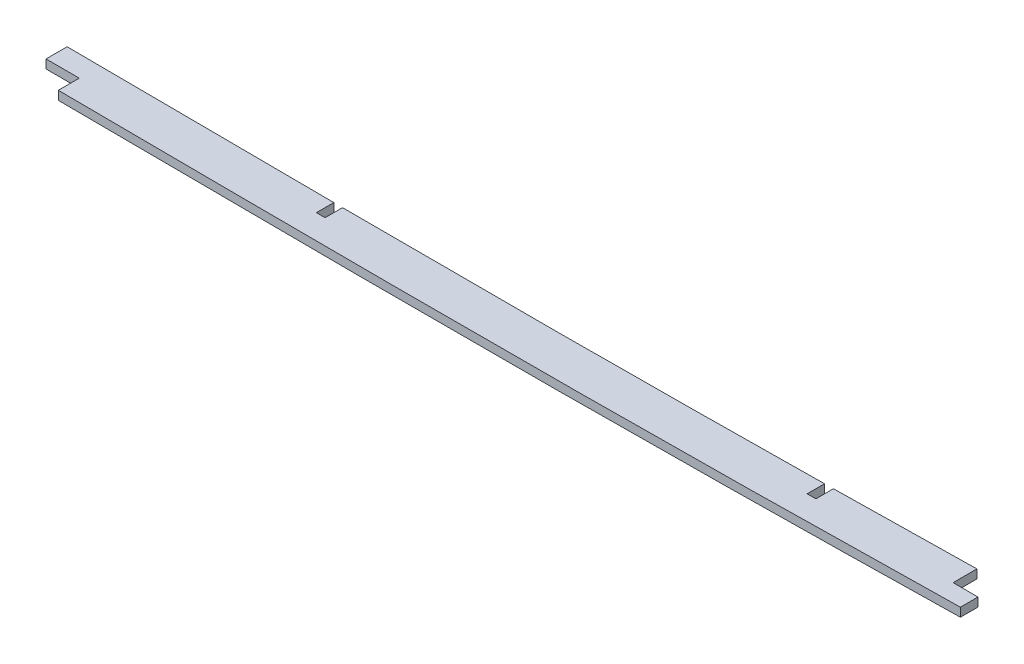
ISO-10303-21;
HEADER;
FILE_DESCRIPTION(('STEP AP214'),'2;1');
FILE_NAME('part.step','',(''),(''),'','','');
FILE_SCHEMA(('AUTOMOTIVE_DESIGN { 1 0 10303 214 1 1 1 1 }'));
ENDSEC;
DATA;
#1=APPLICATION_CONTEXT('core data for automotive mechanical design processes');
#2=APPLICATION_PROTOCOL_DEFINITION('international standard','automotive_design',2000,#1);
#3=PRODUCT_CONTEXT('',#1,'mechanical');
#4=PRODUCT('Part','Part','',(#3));
#5=PRODUCT_RELATED_PRODUCT_CATEGORY('part','',(#4));
#6=PRODUCT_DEFINITION_FORMATION('','',#4);
#7=PRODUCT_DEFINITION_CONTEXT('part definition',#1,'design');
#8=PRODUCT_DEFINITION('design','',#6,#7);
#9=PRODUCT_DEFINITION_SHAPE('','',#8);
#10=(LENGTH_UNIT() NAMED_UNIT(*) SI_UNIT(.MILLI.,.METRE.));
#11=(NAMED_UNIT(*) PLANE_ANGLE_UNIT() SI_UNIT($,.RADIAN.));
#12=(NAMED_UNIT(*) SI_UNIT($,.STERADIAN.) SOLID_ANGLE_UNIT());
#13=UNCERTAINTY_MEASURE_WITH_UNIT(LENGTH_MEASURE(1.E-05),#10,'distance_accuracy_value','');
#14=(GEOMETRIC_REPRESENTATION_CONTEXT(3) GLOBAL_UNCERTAINTY_ASSIGNED_CONTEXT((#13)) GLOBAL_UNIT_ASSIGNED_CONTEXT((#10,
#11,#12)) REPRESENTATION_CONTEXT('',''));
#15=CARTESIAN_POINT('',(0.,0.,0.));
#16=DIRECTION('',(0.,0.,1.));
#17=DIRECTION('',(1.,0.,0.));
#18=AXIS2_PLACEMENT_3D('',#15,#16,#17);
#19=CARTESIAN_POINT('',(616.337750913255,1.5875,99.0566103609531));
#20=CARTESIAN_POINT('',(647.76049660052,1.5875,99.0799542657679));
#21=CARTESIAN_POINT('',(694.87068034325,1.5875,98.960929783245));
#22=CARTESIAN_POINT('',(757.779786958647,1.5875,98.8040630386954));
#23=CARTESIAN_POINT('',(820.69045818609,1.5875,98.7653484328497));
#24=CARTESIAN_POINT('',(899.289299877085,1.5875,98.7967965825531));
#25=CARTESIAN_POINT('',(993.586772551322,1.5875,98.8129149281116));
#26=CARTESIAN_POINT('',(1087.93191592796,1.5875,98.7323574871025));
#27=CARTESIAN_POINT('',(1182.33953079348,1.5875,99.1244994990799));
#28=CARTESIAN_POINT('',(1276.65398068122,1.5875,99.8147611994573));
#29=CARTESIAN_POINT('',(1370.85083148495,1.5875,100.131815232071));
#30=CARTESIAN_POINT('',(1464.98207813977,1.5875,99.4108190462021));
#31=CARTESIAN_POINT('',(1590.54945268054,1.5875,97.1511702631117));
#32=CARTESIAN_POINT('',(1747.54008126415,1.5875,92.7833872927443));
#33=CARTESIAN_POINT('',(1904.58058478476,1.5875,87.4795525069474));
#34=CARTESIAN_POINT('',(2030.20455421821,1.5875,82.9558758992198));
#35=CARTESIAN_POINT('',(2092.98705848864,1.5875,80.5357121207426));
#36=CARTESIAN_POINT('',(2124.37829951673,1.5875,79.2527491986346));
#37=B_SPLINE_CURVE_WITH_KNOTS('',3,(#19,#20,#21,#22,#23,#24,#25,#26,#27,#28,#29,#30,#31,#32,#33,
#34,#35,#36),.UNSPECIFIED.,.F.,.F.,(4,1,1,1,1,1,1,1,1,1,1,1,1,1,1,4),(0.,0.0625,0.09375,0.125,
0.1875,0.25,0.3125,0.375,0.4375,0.5,0.5625,0.625,0.75,0.875,0.9375,1.),.UNSPECIFIED.);
#38=DIRECTION('',(0.,-1.,0.));
#39=VECTOR('',#38,1.);
#40=SURFACE_OF_LINEAR_EXTRUSION('',#37,#39);
#41=DIRECTION('',(0.,-1.,0.));
#42=VECTOR('',#41,1.);
#43=CARTESIAN_POINT('',(1196.22315473829,1.5875,99.2567866166123));
#44=LINE('',#43,#42);
#45=CARTESIAN_POINT('',(1196.22315473829,1.5875,99.2567866166594));
#46=VERTEX_POINT('',#45);
#47=CARTESIAN_POINT('',(1196.2231559473,-1.5875,99.2573829498002));
#48=VERTEX_POINT('',#47);
#49=EDGE_CURVE('E198',#46,#48,#44,.T.);
#50=ORIENTED_EDGE('',*,*,#49,.F.);
#51=CARTESIAN_POINT('',(1293.8124999904,1.5875,99.8374914295219));
#52=VERTEX_POINT('',#51);
#53=EDGE_CURVE('E276',#46,#52,#37,.T.);
#54=ORIENTED_EDGE('',*,*,#53,.T.);
#55=DIRECTION('',(0.,1.,0.));
#56=VECTOR('',#55,1.);
#57=CARTESIAN_POINT('',(1293.8124999904,-1.59253086897977,99.8374914295219));
#58=LINE('',#57,#56);
#59=CARTESIAN_POINT('',(1293.81249894314,-1.58980443138142,99.8372619108357));
#60=VERTEX_POINT('',#59);
#61=EDGE_CURVE('E255',#60,#52,#58,.T.);
#62=ORIENTED_EDGE('',*,*,#61,.F.);
#63=CARTESIAN_POINT('',(1293.81249614987,-1.5875,99.8374914122178));
#64=CARTESIAN_POINT('',(1288.0870738834,-1.5875,99.8116947241899));
#65=CARTESIAN_POINT('',(1255.57376786315,-1.5875,99.6496729828722));
#66=CARTESIAN_POINT('',(1223.03946754081,-1.5875,99.4210245787221));
#67=CARTESIAN_POINT('',(1196.22315959104,-1.5875,99.2567866463332));
#68=B_SPLINE_CURVE_WITH_KNOTS('',3,(#63,#64,#65,#66,#67),.UNSPECIFIED.,.F.,.F.,(4,1,4),
(0.384206779927724,0.395598680735028,0.448891900807304),.UNSPECIFIED.);
#69=EDGE_CURVE('E367',#48,#60,#68,.F.);
#70=ORIENTED_EDGE('',*,*,#69,.F.);
#71=EDGE_LOOP('',(#50,#54,#62,#70));
#72=FACE_BOUND('',#71,.T.);
#73=ADVANCED_FACE('F40',(#72),#40,.T.);
#74=DIRECTION('',(0.,1.,0.));
#75=VECTOR('',#74,1.);
#76=CARTESIAN_POINT('',(1296.9875,-1.59253086897977,99.851512251349));
#77=LINE('',#76,#75);
#78=CARTESIAN_POINT('',(1296.9874986462,-1.58974027845912,99.8512051452255));
#79=VERTEX_POINT('',#78);
#80=CARTESIAN_POINT('',(1296.9875,1.5875,99.851512251349));
#81=VERTEX_POINT('',#80);
#82=EDGE_CURVE('E232',#79,#81,#77,.T.);
#83=ORIENTED_EDGE('',*,*,#82,.T.);
#84=CARTESIAN_POINT('',(1471.6125,1.5875,99.161176944385));
#85=VERTEX_POINT('',#84);
#86=EDGE_CURVE('E286',#81,#85,#37,.T.);
#87=ORIENTED_EDGE('',*,*,#86,.T.);
#88=DIRECTION('',(0.,1.,0.));
#89=VECTOR('',#88,1.);
#90=CARTESIAN_POINT('',(1471.6125,-1.59253086897977,99.161176944385));
#91=LINE('',#90,#89);
#92=CARTESIAN_POINT('',(1471.61250017465,-1.59000259299136,99.1611640336113));
#93=VERTEX_POINT('',#92);
#94=EDGE_CURVE('E221',#93,#85,#91,.T.);
#95=ORIENTED_EDGE('',*,*,#94,.F.);
#96=CARTESIAN_POINT('',(1471.6125006954,-1.5875,99.1611769349648));
#97=CARTESIAN_POINT('',(1469.40478478669,-1.5875,99.1910835081403));
#98=CARTESIAN_POINT('',(1435.81212145737,-1.5875,99.6342456793062));
#99=CARTESIAN_POINT('',(1377.62713242594,-1.5875,100.079912306036));
#100=CARTESIAN_POINT('',(1321.6144682623,-1.5875,99.9580247764968));
#101=CARTESIAN_POINT('',(1296.98749516492,-1.5875,99.8515122304371));
#102=B_SPLINE_CURVE_WITH_KNOTS('',3,(#96,#97,#98,#99,#100,#101),.UNSPECIFIED.,.F.,.F.,(4,1,1,4),
(0.450997711669492,0.455394084316005,0.517894084316005,0.566896372646514),.UNSPECIFIED.);
#103=EDGE_CURVE('E328',#79,#93,#102,.F.);
#104=ORIENTED_EDGE('',*,*,#103,.F.);
#105=EDGE_LOOP('',(#83,#87,#95,#104));
#106=FACE_BOUND('',#105,.T.);
#107=ADVANCED_FACE('F297',(#106),#40,.T.);
#108=DIRECTION('',(0.,-1.,0.));
#109=VECTOR('',#108,1.);
#110=CARTESIAN_POINT('',(1526.14075421475,1.5875,98.2750837700095));
#111=LINE('',#110,#109);
#112=CARTESIAN_POINT('',(1526.14075421818,-1.5875,98.2746680340119));
#113=VERTEX_POINT('',#112);
#114=CARTESIAN_POINT('',(1526.14075421475,1.5875,98.2750837700095));
#115=VERTEX_POINT('',#114);
#116=EDGE_CURVE('E173',#113,#115,#111,.F.);
#117=ORIENTED_EDGE('',*,*,#116,.F.);
#118=CARTESIAN_POINT('',(1526.14075941432,-1.5875,98.2750836725584));
#119=CARTESIAN_POINT('',(1509.02154697858,-1.5875,98.5959350579333));
#120=CARTESIAN_POINT('',(1491.90350851996,-1.5875,98.8799956310713));
#121=CARTESIAN_POINT('',(1474.78750144146,-1.5875,99.1176304034489));
#122=B_SPLINE_CURVE_WITH_KNOTS('',3,(#118,#119,#120,#121),.UNSPECIFIED.,.F.,.F.,(4,4),
(0.569003887500666,0.603087632694586),.UNSPECIFIED.);
#123=CARTESIAN_POINT('',(1474.78750036865,-1.58998946013187,99.117604171845));
#124=VERTEX_POINT('',#123);
#125=EDGE_CURVE('E333',#124,#113,#122,.F.);
#126=ORIENTED_EDGE('',*,*,#125,.F.);
#127=DIRECTION('',(0.,1.,0.));
#128=VECTOR('',#127,1.);
#129=CARTESIAN_POINT('',(1474.78750000972,-1.59253086897977,99.1176304233269));
#130=LINE('',#129,#128);
#131=CARTESIAN_POINT('',(1474.78750000972,1.5875,99.1176304233269));
#132=VERTEX_POINT('',#131);
#133=EDGE_CURVE('E249',#124,#132,#130,.T.);
#134=ORIENTED_EDGE('',*,*,#133,.T.);
#135=EDGE_CURVE('E287',#132,#115,#37,.T.);
#136=ORIENTED_EDGE('',*,*,#135,.T.);
#137=EDGE_LOOP('',(#117,#126,#134,#136));
#138=FACE_BOUND('',#137,.T.);
#139=ADVANCED_FACE('F299',(#138),#40,.T.);
#140=CARTESIAN_POINT('',(616.326429146063,1.5875,114.296606155493));
#141=CARTESIAN_POINT('',(632.046217380175,1.5875,114.30828435968));
#142=CARTESIAN_POINT('',(647.765968153244,1.5875,114.29677439422));
#143=CARTESIAN_POINT('',(679.205420392794,1.5875,114.24323397025));
#144=CARTESIAN_POINT('',(694.925123066751,1.5875,114.201950932506));
#145=CARTESIAN_POINT('',(726.364532124698,1.5875,114.121681346548));
#146=CARTESIAN_POINT('',(742.084243399862,1.5875,114.083543006226));
#147=CARTESIAN_POINT('',(773.523671882744,1.5875,114.034083388907));
#148=CARTESIAN_POINT('',(789.243390213417,1.5875,114.023396075664));
#149=CARTESIAN_POINT('',(820.682831324826,1.5875,114.017303041489));
#150=CARTESIAN_POINT('',(836.402553623007,1.5875,114.020240225192));
#151=CARTESIAN_POINT('',(867.841997842806,1.5875,114.024821457385));
#152=CARTESIAN_POINT('',(883.561720421664,1.5875,114.028722489467));
#153=CARTESIAN_POINT('',(915.001165910892,1.5875,114.037662965197));
#154=CARTESIAN_POINT('',(930.720888644625,1.5875,114.042095840025));
#155=CARTESIAN_POINT('',(962.160332217753,1.5875,114.044456392842));
#156=CARTESIAN_POINT('',(977.880053630737,1.5875,114.042025852399));
#157=CARTESIAN_POINT('',(1025.03924062521,1.5875,114.02635266127));
#158=CARTESIAN_POINT('',(1056.47872633141,1.5875,114.001081239981));
#159=CARTESIAN_POINT('',(1103.63774370583,1.5875,114.076141518065));
#160=CARTESIAN_POINT('',(1119.35738201238,1.5875,114.119430036675));
#161=CARTESIAN_POINT('',(1150.79658971577,1.5875,114.242868384306));
#162=CARTESIAN_POINT('',(1166.51615941665,1.5875,114.322855573181));
#163=CARTESIAN_POINT('',(1213.67480633689,1.5875,114.596079866728));
#164=CARTESIAN_POINT('',(1245.11381381393,1.5875,114.824335417931));
#165=CARTESIAN_POINT('',(1307.99206873737,1.5875,115.160349224997));
#166=CARTESIAN_POINT('',(1339.43132783757,1.5875,115.262775920084));
#167=CARTESIAN_POINT('',(1386.59071758969,1.5875,115.166774968219));
#168=CARTESIAN_POINT('',(1402.31059775436,1.5875,115.09313610926));
#169=CARTESIAN_POINT('',(1433.75053971329,1.5875,114.855373393272));
#170=CARTESIAN_POINT('',(1449.46971812607,1.5875,114.691491377402));
#171=CARTESIAN_POINT('',(1480.90524720166,1.5875,114.282993412757));
#172=CARTESIAN_POINT('',(1496.62184273389,1.5875,114.038617844409));
#173=CARTESIAN_POINT('',(1528.05323424889,1.5875,113.488096449305));
#174=CARTESIAN_POINT('',(1543.76803918056,1.5875,113.182257797232));
#175=CARTESIAN_POINT('',(1590.91012672281,1.5875,112.184857954141));
#176=CARTESIAN_POINT('',(1622.33508716355,1.5875,111.413587350345));
#177=CARTESIAN_POINT('',(1685.18062244756,1.5875,109.720508746898));
#178=CARTESIAN_POINT('',(1716.60120600918,1.5875,108.799000007991));
#179=CARTESIAN_POINT('',(1779.43954296825,1.5875,106.858836007746));
#180=CARTESIAN_POINT('',(1810.85730451947,1.5875,105.840460627799));
#181=CARTESIAN_POINT('',(1873.69102784609,1.5875,103.741931839349));
#182=CARTESIAN_POINT('',(1905.10699770462,1.5875,102.662055887814));
#183=CARTESIAN_POINT('',(1967.93740090808,1.5875,100.449562537391));
#184=CARTESIAN_POINT('',(1999.35184226252,1.5875,99.3172200683351));
#185=CARTESIAN_POINT('',(2062.17844269824,1.5875,96.9741951872324));
#186=CARTESIAN_POINT('',(2093.59060920955,1.5875,95.7637678134024));
#187=CARTESIAN_POINT('',(2125.00064017427,1.5875,94.4800369448474));
#188=B_SPLINE_CURVE_WITH_KNOTS('',3,(#140,#141,#142,#143,#144,#145,#146,#147,#148,#149,#150,
#151,#152,#153,#154,#155,#156,#157,#158,#159,#160,#161,#162,#163,#164,#165,#166,#167,#168,#169,
#170,#171,#172,#173,#174,#175,#176,#177,#178,#179,#180,#181,#182,#183,#184,#185,#186,#187),
.UNSPECIFIED.,.F.,.F.,(4,2,2,2,2,2,2,2,2,2,2,2,2,2,2,2,2,2,2,2,2,2,2,4),(0.,0.0312499999999999,
0.0624999999999998,0.0937499999999997,0.125,0.156249999999999,0.187499999999999,
0.218749999999999,0.249999999999999,0.312499999999999,0.343749999999999,0.374999999999999,
0.437499999999998,0.499999999999998,0.531249999999998,0.562499999999998,0.593749999999999,
0.624999999999999,0.687499999999999,0.749999999999999,0.812499999999999,0.875,0.9375,1.),.UNSPECIFIED.);
#189=DIRECTION('',(0.,-1.,0.));
#190=VECTOR('',#189,1.);
#191=SURFACE_OF_LINEAR_EXTRUSION('',#188,#190);
#192=CARTESIAN_POINT('',(1208.33439349792,-1.5875,114.573476594553));
#193=CARTESIAN_POINT('',(1231.07389974292,-1.5875,114.717788641424));
#194=CARTESIAN_POINT('',(1253.81338912454,-1.5875,114.870824898651));
#195=CARTESIAN_POINT('',(1307.99206873737,-1.5875,115.160349224997));
#196=CARTESIAN_POINT('',(1339.43132783757,-1.5875,115.262775920084));
#197=CARTESIAN_POINT('',(1386.59071758969,-1.5875,115.166774968219));
#198=CARTESIAN_POINT('',(1402.31059775436,-1.5875,115.09313610926));
#199=CARTESIAN_POINT('',(1433.75053971329,-1.5875,114.855373393272));
#200=CARTESIAN_POINT('',(1449.46971812607,-1.5875,114.691491377402));
#201=CARTESIAN_POINT('',(1480.90524720166,-1.5875,114.282993412757));
#202=CARTESIAN_POINT('',(1496.62184273389,-1.5875,114.038617844409));
#203=CARTESIAN_POINT('',(1519.95703659589,-1.5875,113.62990149872));
#204=CARTESIAN_POINT('',(1527.57632529961,-1.5875,113.489258084488));
#205=CARTESIAN_POINT('',(1535.19541771725,-1.5875,113.341877072037));
#206=B_SPLINE_CURVE_WITH_KNOTS('',3,(#192,#193,#194,#195,#196,#197,#198,#199,#200,#201,#202,
#203,#204,#205),.UNSPECIFIED.,.F.,.F.,(4,2,2,2,2,2,4),(0.392294483047431,0.437499999999998,
0.499999999999998,0.531249999999998,0.562499999999998,0.593749999999999,0.60890105149907),.UNSPECIFIED.);
#207=CARTESIAN_POINT('',(1208.33439316259,-1.5875,114.573529382344));
#208=VERTEX_POINT('',#207);
#209=CARTESIAN_POINT('',(1535.1954174423,-1.5875,113.341862857388));
#210=VERTEX_POINT('',#209);
#211=EDGE_CURVE('E261',#208,#210,#206,.T.);
#212=ORIENTED_EDGE('',*,*,#211,.T.);
#213=DIRECTION('',(0.,-1.,0.));
#214=VECTOR('',#213,1.);
#215=CARTESIAN_POINT('',(1535.1954174423,1.5875,113.341877077355));
#216=LINE('',#215,#214);
#217=CARTESIAN_POINT('',(1535.1954174423,1.5875,113.341869989709));
#218=VERTEX_POINT('',#217);
#219=EDGE_CURVE('E207',#210,#218,#216,.F.);
#220=ORIENTED_EDGE('',*,*,#219,.T.);
#221=CARTESIAN_POINT('',(1535.19541771639,1.5875,113.341877072053));
#222=CARTESIAN_POINT('',(1527.57632529903,1.5875,113.489258084499));
#223=CARTESIAN_POINT('',(1519.9570365956,1.5875,113.629901498725));
#224=CARTESIAN_POINT('',(1496.62184273389,1.5875,114.038617844409));
#225=CARTESIAN_POINT('',(1480.90524720166,1.5875,114.282993412757));
#226=CARTESIAN_POINT('',(1449.46971812607,1.5875,114.691491377402));
#227=CARTESIAN_POINT('',(1433.75053971329,1.5875,114.855373393272));
#228=CARTESIAN_POINT('',(1402.31059775436,1.5875,115.09313610926));
#229=CARTESIAN_POINT('',(1386.59071758969,1.5875,115.166774968219));
#230=CARTESIAN_POINT('',(1339.43132783757,1.5875,115.262775920084));
#231=CARTESIAN_POINT('',(1307.99206873737,1.5875,115.160349224997));
#232=CARTESIAN_POINT('',(1253.81338912409,1.5875,114.870824898648));
#233=CARTESIAN_POINT('',(1231.07389974202,1.5875,114.717788641418));
#234=CARTESIAN_POINT('',(1208.33439349657,1.5875,114.573476594544));
#235=B_SPLINE_CURVE_WITH_KNOTS('',3,(#221,#222,#223,#224,#225,#226,#227,#228,#229,#230,#231,
#232,#233,#234),.UNSPECIFIED.,.F.,.F.,(4,2,2,2,2,2,4),(0.392294483046538,0.407445534545041,
0.438695534545041,0.469945534545041,0.501195534545041,0.563695534545041,0.608901051498502),.UNSPECIFIED.);
#236=CARTESIAN_POINT('',(1208.33439305176,1.5875,114.573511769636));
#237=VERTEX_POINT('',#236);
#238=EDGE_CURVE('E374',#237,#218,#235,.F.);
#239=ORIENTED_EDGE('',*,*,#238,.F.);
#240=DIRECTION('',(0.,-1.,0.));
#241=VECTOR('',#240,1.);
#242=CARTESIAN_POINT('',(1208.33439305176,1.5875,114.573476591721));
#243=LINE('',#242,#241);
#244=EDGE_CURVE('E194',#237,#208,#243,.T.);
#245=ORIENTED_EDGE('',*,*,#244,.T.);
#246=EDGE_LOOP('',(#212,#220,#239,#245));
#247=FACE_BOUND('',#246,.T.);
#248=ADVANCED_FACE('F42',(#247),#191,.F.);
#249=CARTESIAN_POINT('',(0.,1.5875,0.));
#250=DIRECTION('',(0.,1.,0.));
#251=DIRECTION('',(0.,0.,1.));
#252=AXIS2_PLACEMENT_3D('',#249,#250,#251);
#253=PLANE('',#252);
#254=DIRECTION('',(0.,0.,1.));
#255=VECTOR('',#254,1.);
#256=CARTESIAN_POINT('',(1535.1954174423,1.5875,119.165140120626));
#257=LINE('',#256,#255);
#258=CARTESIAN_POINT('',(1535.1954174423,1.5875,106.937874616711));
#259=VERTEX_POINT('',#258);
#260=EDGE_CURVE('E167',#259,#218,#257,.T.);
#261=ORIENTED_EDGE('',*,*,#260,.F.);
#262=DIRECTION('',(1.,0.,0.));
#263=VECTOR('',#262,1.);
#264=CARTESIAN_POINT('',(1526.14075421475,1.5875,106.937874616711));
#265=LINE('',#264,#263);
#266=CARTESIAN_POINT('',(1526.14075421475,1.5875,106.937874616711));
#267=VERTEX_POINT('',#266);
#268=EDGE_CURVE('E161',#267,#259,#265,.T.);
#269=ORIENTED_EDGE('',*,*,#268,.F.);
#270=DIRECTION('',(0.,0.,1.));
#271=VECTOR('',#270,1.);
#272=CARTESIAN_POINT('',(1526.14075421475,1.5875,98.2750837700095));
#273=LINE('',#272,#271);
#274=EDGE_CURVE('E170',#115,#267,#273,.T.);
#275=ORIENTED_EDGE('',*,*,#274,.F.);
#276=ORIENTED_EDGE('',*,*,#135,.F.);
#277=DIRECTION('',(0.,0.,-1.));
#278=VECTOR('',#277,1.);
#279=CARTESIAN_POINT('',(1474.7875,1.5875,0.));
#280=LINE('',#279,#278);
#281=CARTESIAN_POINT('',(1474.7875,1.5875,105.489537584475));
#282=VERTEX_POINT('',#281);
#283=EDGE_CURVE('E242',#282,#132,#280,.T.);
#284=ORIENTED_EDGE('',*,*,#283,.F.);
#285=DIRECTION('',(1.,0.,0.));
#286=VECTOR('',#285,1.);
#287=CARTESIAN_POINT('',(0.,1.5875,105.489537584475));
#288=LINE('',#287,#286);
#289=CARTESIAN_POINT('',(1471.6125,1.5875,105.489537584475));
#290=VERTEX_POINT('',#289);
#291=EDGE_CURVE('E238',#290,#282,#288,.T.);
#292=ORIENTED_EDGE('',*,*,#291,.F.);
#293=DIRECTION('',(0.,0.,1.));
#294=VECTOR('',#293,1.);
#295=CARTESIAN_POINT('',(1471.6125,1.5875,0.));
#296=LINE('',#295,#294);
#297=EDGE_CURVE('E213',#85,#290,#296,.T.);
#298=ORIENTED_EDGE('',*,*,#297,.F.);
#299=ORIENTED_EDGE('',*,*,#86,.F.);
#300=DIRECTION('',(0.,0.,-1.));
#301=VECTOR('',#300,1.);
#302=CARTESIAN_POINT('',(1296.98750000001,1.5875,9.09059417431002E-11));
#303=LINE('',#302,#301);
#304=CARTESIAN_POINT('',(1296.9875,1.5875,106.187491429565));
#305=VERTEX_POINT('',#304);
#306=EDGE_CURVE('E225',#305,#81,#303,.T.);
#307=ORIENTED_EDGE('',*,*,#306,.F.);
#308=DIRECTION('',(1.,0.,0.));
#309=VECTOR('',#308,1.);
#310=CARTESIAN_POINT('',(0.,1.5875,106.187491429565));
#311=LINE('',#310,#309);
#312=CARTESIAN_POINT('',(1293.8125,1.5875,106.187491429565));
#313=VERTEX_POINT('',#312);
#314=EDGE_CURVE('E220',#313,#305,#311,.T.);
#315=ORIENTED_EDGE('',*,*,#314,.F.);
#316=DIRECTION('',(0.,0.,1.));
#317=VECTOR('',#316,1.);
#318=CARTESIAN_POINT('',(1293.8125,1.5875,0.));
#319=LINE('',#318,#317);
#320=EDGE_CURVE('E216',#52,#313,#319,.T.);
#321=ORIENTED_EDGE('',*,*,#320,.F.);
#322=ORIENTED_EDGE('',*,*,#53,.F.);
#323=DIRECTION('',(0.,0.,-1.));
#324=VECTOR('',#323,1.);
#325=CARTESIAN_POINT('',(1196.22315473829,1.5875,99.2567866166123));
#326=LINE('',#325,#324);
#327=CARTESIAN_POINT('',(1196.22315473829,1.5875,106.937874616711));
#328=VERTEX_POINT('',#327);
#329=EDGE_CURVE('E382',#328,#46,#326,.T.);
#330=ORIENTED_EDGE('',*,*,#329,.F.);
#331=DIRECTION('',(-1.,0.,0.));
#332=VECTOR('',#331,1.);
#333=CARTESIAN_POINT('',(1196.22315473829,1.5875,106.937874616711));
#334=LINE('',#333,#332);
#335=CARTESIAN_POINT('',(1208.33439305176,1.5875,106.937874616711));
#336=VERTEX_POINT('',#335);
#337=EDGE_CURVE('E618',#336,#328,#334,.T.);
#338=ORIENTED_EDGE('',*,*,#337,.F.);
#339=DIRECTION('',(0.,0.,-1.));
#340=VECTOR('',#339,1.);
#341=CARTESIAN_POINT('',(1208.33439305176,1.5875,106.937874616711));
#342=LINE('',#341,#340);
#343=EDGE_CURVE('E191',#237,#336,#342,.T.);
#344=ORIENTED_EDGE('',*,*,#343,.F.);
#345=ORIENTED_EDGE('',*,*,#238,.T.);
#346=EDGE_LOOP('',(#261,#269,#275,#276,#284,#292,#298,#299,#307,#315,#321,#322,#330,#338,#344,#345));
#347=FACE_BOUND('',#346,.T.);
#348=ADVANCED_FACE('F180',(#347),#253,.T.);
#349=CARTESIAN_POINT('',(0.,-1.5875,0.));
#350=DIRECTION('',(0.,1.,0.));
#351=DIRECTION('',(0.,0.,1.));
#352=AXIS2_PLACEMENT_3D('',#349,#350,#351);
#353=PLANE('',#352);
#354=DIRECTION('',(1.,0.,0.));
#355=VECTOR('',#354,1.);
#356=CARTESIAN_POINT('',(0.,-1.5875,106.937874616711));
#357=LINE('',#356,#355);
#358=CARTESIAN_POINT('',(1526.14075421475,-1.5875,106.937874616711));
#359=VERTEX_POINT('',#358);
#360=CARTESIAN_POINT('',(1535.1954174423,-1.5875,106.937874616711));
#361=VERTEX_POINT('',#360);
#362=EDGE_CURVE('E53',#359,#361,#357,.T.);
#363=ORIENTED_EDGE('',*,*,#362,.T.);
#364=DIRECTION('',(0.,0.,1.));
#365=VECTOR('',#364,1.);
#366=CARTESIAN_POINT('',(1535.1954174423,-1.5875,0.));
#367=LINE('',#366,#365);
#368=EDGE_CURVE('E11',#361,#210,#367,.T.);
#369=ORIENTED_EDGE('',*,*,#368,.T.);
#370=ORIENTED_EDGE('',*,*,#211,.F.);
#371=DIRECTION('',(0.,0.,-1.));
#372=VECTOR('',#371,1.);
#373=CARTESIAN_POINT('',(1208.33439305176,-1.5875,0.));
#374=LINE('',#373,#372);
#375=CARTESIAN_POINT('',(1208.33439305176,-1.5875,106.937874616711));
#376=VERTEX_POINT('',#375);
#377=EDGE_CURVE('E364',#208,#376,#374,.T.);
#378=ORIENTED_EDGE('',*,*,#377,.T.);
#379=DIRECTION('',(-1.,0.,0.));
#380=VECTOR('',#379,1.);
#381=CARTESIAN_POINT('',(0.,-1.5875,106.937874616711));
#382=LINE('',#381,#380);
#383=CARTESIAN_POINT('',(1196.22315473829,-1.5875,106.937874616711));
#384=VERTEX_POINT('',#383);
#385=EDGE_CURVE('E413',#376,#384,#382,.T.);
#386=ORIENTED_EDGE('',*,*,#385,.T.);
#387=DIRECTION('',(0.,0.,-1.));
#388=VECTOR('',#387,1.);
#389=CARTESIAN_POINT('',(1196.22315473829,-1.5875,0.));
#390=LINE('',#389,#388);
#391=EDGE_CURVE('E370',#384,#48,#390,.T.);
#392=ORIENTED_EDGE('',*,*,#391,.T.);
#393=ORIENTED_EDGE('',*,*,#69,.T.);
#394=DIRECTION('',(0.,0.,1.));
#395=VECTOR('',#394,1.);
#396=CARTESIAN_POINT('',(1293.8125,-1.5875,0.));
#397=LINE('',#396,#395);
#398=CARTESIAN_POINT('',(1293.8125,-1.5875,106.187491429565));
#399=VERTEX_POINT('',#398);
#400=EDGE_CURVE('E358',#60,#399,#397,.T.);
#401=ORIENTED_EDGE('',*,*,#400,.T.);
#402=DIRECTION('',(1.,0.,0.));
#403=VECTOR('',#402,1.);
#404=CARTESIAN_POINT('',(0.,-1.5875,106.187491429565));
#405=LINE('',#404,#403);
#406=CARTESIAN_POINT('',(1296.9875,-1.5875,106.187491429565));
#407=VERTEX_POINT('',#406);
#408=EDGE_CURVE('E348',#399,#407,#405,.T.);
#409=ORIENTED_EDGE('',*,*,#408,.T.);
#410=DIRECTION('',(0.,0.,-1.));
#411=VECTOR('',#410,1.);
#412=CARTESIAN_POINT('',(1296.98750000001,-1.5875,9.09059417431002E-11));
#413=LINE('',#412,#411);
#414=EDGE_CURVE('E354',#407,#79,#413,.T.);
#415=ORIENTED_EDGE('',*,*,#414,.T.);
#416=ORIENTED_EDGE('',*,*,#103,.T.);
#417=DIRECTION('',(0.,0.,1.));
#418=VECTOR('',#417,1.);
#419=CARTESIAN_POINT('',(1471.6125,-1.5875,0.));
#420=LINE('',#419,#418);
#421=CARTESIAN_POINT('',(1471.6125,-1.5875,105.489537584475));
#422=VERTEX_POINT('',#421);
#423=EDGE_CURVE('E342',#93,#422,#420,.T.);
#424=ORIENTED_EDGE('',*,*,#423,.T.);
#425=DIRECTION('',(1.,0.,0.));
#426=VECTOR('',#425,1.);
#427=CARTESIAN_POINT('',(0.,-1.5875,105.489537584475));
#428=LINE('',#427,#426);
#429=CARTESIAN_POINT('',(1474.7875,-1.5875,105.489537584475));
#430=VERTEX_POINT('',#429);
#431=EDGE_CURVE('E285',#422,#430,#428,.T.);
#432=ORIENTED_EDGE('',*,*,#431,.T.);
#433=DIRECTION('',(0.,0.,-1.));
#434=VECTOR('',#433,1.);
#435=CARTESIAN_POINT('',(1474.7875,-1.5875,0.));
#436=LINE('',#435,#434);
#437=EDGE_CURVE('E339',#430,#124,#436,.T.);
#438=ORIENTED_EDGE('',*,*,#437,.T.);
#439=ORIENTED_EDGE('',*,*,#125,.T.);
#440=DIRECTION('',(0.,0.,1.));
#441=VECTOR('',#440,1.);
#442=CARTESIAN_POINT('',(1526.14075421475,-1.5875,0.));
#443=LINE('',#442,#441);
#444=EDGE_CURVE('E404',#113,#359,#443,.T.);
#445=ORIENTED_EDGE('',*,*,#444,.T.);
#446=EDGE_LOOP('',(#363,#369,#370,#378,#386,#392,#393,#401,#409,#415,#416,#424,#432,#438,#439,#445));
#447=FACE_BOUND('',#446,.T.);
#448=ADVANCED_FACE('F300',(#447),#353,.F.);
#449=CARTESIAN_POINT('',(1471.6125,-1.59253086897977,0.));
#450=DIRECTION('',(-1.,0.,0.));
#451=DIRECTION('',(0.,0.,1.));
#452=AXIS2_PLACEMENT_3D('',#449,#450,#451);
#453=PLANE('',#452);
#454=ORIENTED_EDGE('',*,*,#94,.T.);
#455=ORIENTED_EDGE('',*,*,#297,.T.);
#456=DIRECTION('',(0.,1.,0.));
#457=VECTOR('',#456,1.);
#458=CARTESIAN_POINT('',(1471.6125,-1.59253086897977,105.489537584475));
#459=LINE('',#458,#457);
#460=EDGE_CURVE('E245',#422,#290,#459,.T.);
#461=ORIENTED_EDGE('',*,*,#460,.F.);
#462=ORIENTED_EDGE('',*,*,#423,.F.);
#463=EDGE_LOOP('',(#454,#455,#461,#462));
#464=FACE_BOUND('',#463,.T.);
#465=ADVANCED_FACE('F489',(#464),#453,.F.);
#466=CARTESIAN_POINT('',(1474.7875,-1.59253086897977,0.));
#467=DIRECTION('',(1.,0.,0.));
#468=DIRECTION('',(0.,0.,-1.));
#469=AXIS2_PLACEMENT_3D('',#466,#467,#468);
#470=PLANE('',#469);
#471=DIRECTION('',(0.,1.,0.));
#472=VECTOR('',#471,1.);
#473=CARTESIAN_POINT('',(1474.7875,-1.59253086897977,105.489537584475));
#474=LINE('',#473,#472);
#475=EDGE_CURVE('E246',#430,#282,#474,.T.);
#476=ORIENTED_EDGE('',*,*,#475,.T.);
#477=ORIENTED_EDGE('',*,*,#283,.T.);
#478=ORIENTED_EDGE('',*,*,#133,.F.);
#479=ORIENTED_EDGE('',*,*,#437,.F.);
#480=EDGE_LOOP('',(#476,#477,#478,#479));
#481=FACE_BOUND('',#480,.T.);
#482=ADVANCED_FACE('F497',(#481),#470,.F.);
#483=CARTESIAN_POINT('',(0.,-1.59253086897977,105.489537584475));
#484=DIRECTION('',(0.,0.,1.));
#485=DIRECTION('',(1.,0.,0.));
#486=AXIS2_PLACEMENT_3D('',#483,#484,#485);
#487=PLANE('',#486);
#488=ORIENTED_EDGE('',*,*,#460,.T.);
#489=ORIENTED_EDGE('',*,*,#291,.T.);
#490=ORIENTED_EDGE('',*,*,#475,.F.);
#491=ORIENTED_EDGE('',*,*,#431,.F.);
#492=EDGE_LOOP('',(#488,#489,#490,#491));
#493=FACE_BOUND('',#492,.T.);
#494=ADVANCED_FACE('F505',(#493),#487,.F.);
#495=CARTESIAN_POINT('',(1293.8125,-1.59253086897977,0.));
#496=DIRECTION('',(-1.,0.,0.));
#497=DIRECTION('',(0.,0.,1.));
#498=AXIS2_PLACEMENT_3D('',#495,#496,#497);
#499=PLANE('',#498);
#500=ORIENTED_EDGE('',*,*,#61,.T.);
#501=ORIENTED_EDGE('',*,*,#320,.T.);
#502=DIRECTION('',(0.,1.,0.));
#503=VECTOR('',#502,1.);
#504=CARTESIAN_POINT('',(1293.8125,-1.59253086897977,106.187491429565));
#505=LINE('',#504,#503);
#506=EDGE_CURVE('E228',#399,#313,#505,.T.);
#507=ORIENTED_EDGE('',*,*,#506,.F.);
#508=ORIENTED_EDGE('',*,*,#400,.F.);
#509=EDGE_LOOP('',(#500,#501,#507,#508));
#510=FACE_BOUND('',#509,.T.);
#511=ADVANCED_FACE('F377',(#510),#499,.F.);
#512=CARTESIAN_POINT('',(1296.98750000001,-1.59253086897977,9.09059417431002E-11));
#513=DIRECTION('',(1.,0.,0.));
#514=DIRECTION('',(0.,0.,-1.));
#515=AXIS2_PLACEMENT_3D('',#512,#513,#514);
#516=PLANE('',#515);
#517=DIRECTION('',(0.,1.,0.));
#518=VECTOR('',#517,1.);
#519=CARTESIAN_POINT('',(1296.9875,-1.59253086897977,106.187491429565));
#520=LINE('',#519,#518);
#521=EDGE_CURVE('E229',#407,#305,#520,.T.);
#522=ORIENTED_EDGE('',*,*,#521,.T.);
#523=ORIENTED_EDGE('',*,*,#306,.T.);
#524=ORIENTED_EDGE('',*,*,#82,.F.);
#525=ORIENTED_EDGE('',*,*,#414,.F.);
#526=EDGE_LOOP('',(#522,#523,#524,#525));
#527=FACE_BOUND('',#526,.T.);
#528=ADVANCED_FACE('F390',(#527),#516,.F.);
#529=CARTESIAN_POINT('',(0.,-1.59253086897977,106.187491429565));
#530=DIRECTION('',(0.,0.,1.));
#531=DIRECTION('',(1.,0.,0.));
#532=AXIS2_PLACEMENT_3D('',#529,#530,#531);
#533=PLANE('',#532);
#534=ORIENTED_EDGE('',*,*,#506,.T.);
#535=ORIENTED_EDGE('',*,*,#314,.T.);
#536=ORIENTED_EDGE('',*,*,#521,.F.);
#537=ORIENTED_EDGE('',*,*,#408,.F.);
#538=EDGE_LOOP('',(#534,#535,#536,#537));
#539=FACE_BOUND('',#538,.T.);
#540=ADVANCED_FACE('F387',(#539),#533,.F.);
#541=CARTESIAN_POINT('',(1196.22315473829,-6.0325,106.937874616711));
#542=DIRECTION('',(0.,0.,-1.));
#543=DIRECTION('',(-1.,0.,0.));
#544=AXIS2_PLACEMENT_3D('',#541,#542,#543);
#545=PLANE('',#544);
#546=DIRECTION('',(0.,1.,0.));
#547=VECTOR('',#546,1.);
#548=CARTESIAN_POINT('',(1208.33439305176,-6.0325,106.937874616711));
#549=LINE('',#548,#547);
#550=EDGE_CURVE('E69',#376,#336,#549,.T.);
#551=ORIENTED_EDGE('',*,*,#550,.T.);
#552=ORIENTED_EDGE('',*,*,#337,.T.);
#553=DIRECTION('',(0.,1.,0.));
#554=VECTOR('',#553,1.);
#555=CARTESIAN_POINT('',(1196.22315473829,-6.0325,106.937874616711));
#556=LINE('',#555,#554);
#557=EDGE_CURVE('E178',#384,#328,#556,.T.);
#558=ORIENTED_EDGE('',*,*,#557,.F.);
#559=ORIENTED_EDGE('',*,*,#385,.F.);
#560=EDGE_LOOP('',(#551,#552,#558,#559));
#561=FACE_BOUND('',#560,.T.);
#562=ADVANCED_FACE('F532',(#561),#545,.F.);
#563=CARTESIAN_POINT('',(1208.33439305176,-6.0325,106.937874616711));
#564=DIRECTION('',(1.,0.,0.));
#565=DIRECTION('',(0.,0.,-1.));
#566=AXIS2_PLACEMENT_3D('',#563,#564,#565);
#567=PLANE('',#566);
#568=ORIENTED_EDGE('',*,*,#343,.T.);
#569=ORIENTED_EDGE('',*,*,#550,.F.);
#570=ORIENTED_EDGE('',*,*,#377,.F.);
#571=ORIENTED_EDGE('',*,*,#244,.F.);
#572=EDGE_LOOP('',(#568,#569,#570,#571));
#573=FACE_BOUND('',#572,.T.);
#574=ADVANCED_FACE('F538',(#573),#567,.F.);
#575=CARTESIAN_POINT('',(1196.22315473829,-6.0325,99.2567866166123));
#576=DIRECTION('',(1.,0.,0.));
#577=DIRECTION('',(0.,0.,-1.));
#578=AXIS2_PLACEMENT_3D('',#575,#576,#577);
#579=PLANE('',#578);
#580=ORIENTED_EDGE('',*,*,#49,.T.);
#581=ORIENTED_EDGE('',*,*,#391,.F.);
#582=ORIENTED_EDGE('',*,*,#557,.T.);
#583=ORIENTED_EDGE('',*,*,#329,.T.);
#584=EDGE_LOOP('',(#580,#581,#582,#583));
#585=FACE_BOUND('',#584,.T.);
#586=ADVANCED_FACE('F546',(#585),#579,.F.);
#587=CARTESIAN_POINT('',(1535.1954174423,-6.0325,119.165140120626));
#588=DIRECTION('',(-1.,0.,0.));
#589=DIRECTION('',(0.,0.,1.));
#590=AXIS2_PLACEMENT_3D('',#587,#588,#589);
#591=PLANE('',#590);
#592=ORIENTED_EDGE('',*,*,#368,.F.);
#593=DIRECTION('',(0.,1.,0.));
#594=VECTOR('',#593,1.);
#595=CARTESIAN_POINT('',(1535.1954174423,-6.0325,106.937874616711));
#596=LINE('',#595,#594);
#597=EDGE_CURVE('E166',#361,#259,#596,.T.);
#598=ORIENTED_EDGE('',*,*,#597,.T.);
#599=ORIENTED_EDGE('',*,*,#260,.T.);
#600=ORIENTED_EDGE('',*,*,#219,.F.);
#601=EDGE_LOOP('',(#592,#598,#599,#600));
#602=FACE_BOUND('',#601,.T.);
#603=ADVANCED_FACE('F450',(#602),#591,.F.);
#604=CARTESIAN_POINT('',(1526.14075421475,-6.0325,106.937874616711));
#605=DIRECTION('',(0.,0.,1.));
#606=DIRECTION('',(1.,0.,0.));
#607=AXIS2_PLACEMENT_3D('',#604,#605,#606);
#608=PLANE('',#607);
#609=DIRECTION('',(0.,1.,0.));
#610=VECTOR('',#609,1.);
#611=CARTESIAN_POINT('',(1526.14075421475,-6.0325,106.937874616711));
#612=LINE('',#611,#610);
#613=EDGE_CURVE('E61',#359,#267,#612,.T.);
#614=ORIENTED_EDGE('',*,*,#613,.T.);
#615=ORIENTED_EDGE('',*,*,#268,.T.);
#616=ORIENTED_EDGE('',*,*,#597,.F.);
#617=ORIENTED_EDGE('',*,*,#362,.F.);
#618=EDGE_LOOP('',(#614,#615,#616,#617));
#619=FACE_BOUND('',#618,.T.);
#620=ADVANCED_FACE('F158',(#619),#608,.F.);
#621=CARTESIAN_POINT('',(1526.14075421475,-6.0325,98.2750837700095));
#622=DIRECTION('',(-1.,0.,0.));
#623=DIRECTION('',(0.,0.,1.));
#624=AXIS2_PLACEMENT_3D('',#621,#622,#623);
#625=PLANE('',#624);
#626=ORIENTED_EDGE('',*,*,#116,.T.);
#627=ORIENTED_EDGE('',*,*,#274,.T.);
#628=ORIENTED_EDGE('',*,*,#613,.F.);
#629=ORIENTED_EDGE('',*,*,#444,.F.);
#630=EDGE_LOOP('',(#626,#627,#628,#629));
#631=FACE_BOUND('',#630,.T.);
#632=ADVANCED_FACE('F171',(#631),#625,.F.);
#633=CLOSED_SHELL('',(#73,#107,#139,#248,#348,#448,#465,#482,#494,#511,#528,#540,#562,#574,#586,
#603,#620,#632));
#634=MANIFOLD_SOLID_BREP('B2',#633);
#635=ADVANCED_BREP_SHAPE_REPRESENTATION('',(#18,#634),#14);
#636=SHAPE_DEFINITION_REPRESENTATION(#9,#635);
ENDSEC;
END-ISO-10303-21;
